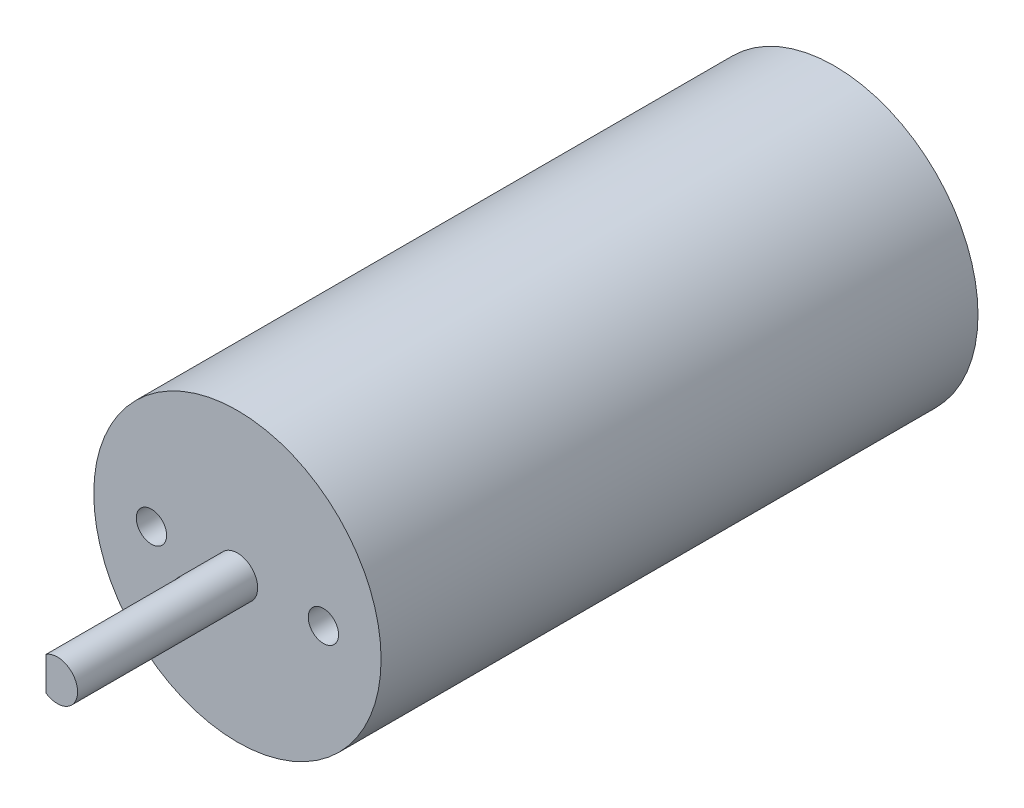
ISO-10303-21;
HEADER;
FILE_DESCRIPTION(('STEP AP214'),'2;1');
FILE_NAME('part.step','',(''),(''),'','','');
FILE_SCHEMA(('AUTOMOTIVE_DESIGN { 1 0 10303 214 1 1 1 1 }'));
ENDSEC;
DATA;
#1=APPLICATION_CONTEXT('core data for automotive mechanical design processes');
#2=APPLICATION_PROTOCOL_DEFINITION('international standard','automotive_design',2000,#1);
#3=PRODUCT_CONTEXT('',#1,'mechanical');
#4=PRODUCT('Part','Part','',(#3));
#5=PRODUCT_RELATED_PRODUCT_CATEGORY('part','',(#4));
#6=PRODUCT_DEFINITION_FORMATION('','',#4);
#7=PRODUCT_DEFINITION_CONTEXT('part definition',#1,'design');
#8=PRODUCT_DEFINITION('design','',#6,#7);
#9=PRODUCT_DEFINITION_SHAPE('','',#8);
#10=(LENGTH_UNIT() NAMED_UNIT(*) SI_UNIT(.MILLI.,.METRE.));
#11=(NAMED_UNIT(*) PLANE_ANGLE_UNIT() SI_UNIT($,.RADIAN.));
#12=(NAMED_UNIT(*) SI_UNIT($,.STERADIAN.) SOLID_ANGLE_UNIT());
#13=UNCERTAINTY_MEASURE_WITH_UNIT(LENGTH_MEASURE(1.E-05),#10,'distance_accuracy_value','');
#14=(GEOMETRIC_REPRESENTATION_CONTEXT(3) GLOBAL_UNCERTAINTY_ASSIGNED_CONTEXT((#13)) GLOBAL_UNIT_ASSIGNED_CONTEXT((#10,
#11,#12)) REPRESENTATION_CONTEXT('',''));
#15=CARTESIAN_POINT('',(0.,0.,0.));
#16=DIRECTION('',(0.,0.,1.));
#17=DIRECTION('',(1.,0.,0.));
#18=AXIS2_PLACEMENT_3D('',#15,#16,#17);
#19=CARTESIAN_POINT('',(0.,0.,76.8));
#20=DIRECTION('',(0.,0.,-1.));
#21=DIRECTION('',(-1.,0.,0.));
#22=AXIS2_PLACEMENT_3D('',#19,#20,#21);
#23=CYLINDRICAL_SURFACE('',#22,2.);
#24=CARTESIAN_POINT('',(0.,0.,59.));
#25=DIRECTION('',(0.,0.,1.));
#26=DIRECTION('',(1.,0.,0.));
#27=AXIS2_PLACEMENT_3D('',#24,#25,#26);
#28=CIRCLE('',#27,2.);
#29=CARTESIAN_POINT('',(2.,0.,59.));
#30=VERTEX_POINT('',#29);
#31=EDGE_CURVE('E91',#30,#30,#28,.T.);
#32=ORIENTED_EDGE('',*,*,#31,.T.);
#33=EDGE_LOOP('',(#32));
#34=FACE_BOUND('',#33,.T.);
#35=DIRECTION('',(0.,0.,-1.));
#36=VECTOR('',#35,1.);
#37=CARTESIAN_POINT('',(-1.12179318114657,1.65577174113253,76.8));
#38=LINE('',#37,#36);
#39=CARTESIAN_POINT('',(-1.12179318114657,1.65577174113253,76.8));
#40=VERTEX_POINT('',#39);
#41=CARTESIAN_POINT('',(-1.12179318114657,1.65577174113253,63.5));
#42=VERTEX_POINT('',#41);
#43=EDGE_CURVE('E75',#40,#42,#38,.T.);
#44=ORIENTED_EDGE('',*,*,#43,.F.);
#45=CARTESIAN_POINT('',(0.,0.,76.8));
#46=DIRECTION('',(0.,0.,1.));
#47=DIRECTION('',(1.,0.,0.));
#48=AXIS2_PLACEMENT_3D('',#45,#46,#47);
#49=CIRCLE('',#48,2.);
#50=CARTESIAN_POINT('',(-1.12179318114657,-1.65577174113253,76.8));
#51=VERTEX_POINT('',#50);
#52=EDGE_CURVE('E80',#51,#40,#49,.T.);
#53=ORIENTED_EDGE('',*,*,#52,.F.);
#54=DIRECTION('',(0.,0.,-1.));
#55=VECTOR('',#54,1.);
#56=CARTESIAN_POINT('',(-1.12179318114657,-1.65577174113253,76.8));
#57=LINE('',#56,#55);
#58=CARTESIAN_POINT('',(-1.12179318114657,-1.65577174113253,63.5));
#59=VERTEX_POINT('',#58);
#60=EDGE_CURVE('E60',#59,#51,#57,.F.);
#61=ORIENTED_EDGE('',*,*,#60,.F.);
#62=CARTESIAN_POINT('',(0.,0.,63.5));
#63=DIRECTION('',(0.,0.,-1.));
#64=DIRECTION('',(-1.,0.,0.));
#65=AXIS2_PLACEMENT_3D('',#62,#63,#64);
#66=CIRCLE('',#65,2.);
#67=EDGE_CURVE('E11',#59,#42,#66,.T.);
#68=ORIENTED_EDGE('',*,*,#67,.T.);
#69=EDGE_LOOP('',(#44,#53,#61,#68));
#70=FACE_BOUND('',#69,.T.);
#71=ADVANCED_FACE('F44',(#34,#70),#23,.T.);
#72=CARTESIAN_POINT('',(0.,0.,76.8));
#73=DIRECTION('',(0.,0.,1.));
#74=DIRECTION('',(1.,0.,0.));
#75=AXIS2_PLACEMENT_3D('',#72,#73,#74);
#76=PLANE('',#75);
#77=ORIENTED_EDGE('',*,*,#52,.T.);
#78=DIRECTION('',(0.,-1.,0.));
#79=VECTOR('',#78,1.);
#80=CARTESIAN_POINT('',(-1.12179318114657,0.,76.8));
#81=LINE('',#80,#79);
#82=EDGE_CURVE('E53',#40,#51,#81,.T.);
#83=ORIENTED_EDGE('',*,*,#82,.T.);
#84=EDGE_LOOP('',(#77,#83));
#85=FACE_BOUND('',#84,.T.);
#86=ADVANCED_FACE('F117',(#85),#76,.T.);
#87=CARTESIAN_POINT('',(0.,0.,59.));
#88=DIRECTION('',(0.,0.,-1.));
#89=DIRECTION('',(-1.,0.,0.));
#90=AXIS2_PLACEMENT_3D('',#87,#88,#89);
#91=CYLINDRICAL_SURFACE('',#90,14.2);
#92=CARTESIAN_POINT('',(0.,0.,59.));
#93=DIRECTION('',(0.,0.,1.));
#94=DIRECTION('',(1.,0.,0.));
#95=AXIS2_PLACEMENT_3D('',#92,#93,#94);
#96=CIRCLE('',#95,14.2);
#97=CARTESIAN_POINT('',(14.2,0.,59.));
#98=VERTEX_POINT('',#97);
#99=EDGE_CURVE('E109',#98,#98,#96,.T.);
#100=ORIENTED_EDGE('',*,*,#99,.F.);
#101=EDGE_LOOP('',(#100));
#102=FACE_BOUND('',#101,.T.);
#103=CARTESIAN_POINT('',(0.,0.,0.));
#104=DIRECTION('',(0.,0.,1.));
#105=DIRECTION('',(1.,0.,0.));
#106=AXIS2_PLACEMENT_3D('',#103,#104,#105);
#107=CIRCLE('',#106,14.2);
#108=CARTESIAN_POINT('',(14.2,0.,0.));
#109=VERTEX_POINT('',#108);
#110=EDGE_CURVE('E105',#109,#109,#107,.T.);
#111=ORIENTED_EDGE('',*,*,#110,.T.);
#112=EDGE_LOOP('',(#111));
#113=FACE_BOUND('',#112,.T.);
#114=ADVANCED_FACE('F46',(#102,#113),#91,.T.);
#115=CARTESIAN_POINT('',(0.,0.,59.));
#116=DIRECTION('',(0.,0.,1.));
#117=DIRECTION('',(1.,0.,0.));
#118=AXIS2_PLACEMENT_3D('',#115,#116,#117);
#119=PLANE('',#118);
#120=CARTESIAN_POINT('',(-8.5,0.,59.));
#121=DIRECTION('',(0.,0.,1.));
#122=DIRECTION('',(1.,0.,0.));
#123=AXIS2_PLACEMENT_3D('',#120,#121,#122);
#124=CIRCLE('',#123,1.5);
#125=CARTESIAN_POINT('',(-7.,0.,59.));
#126=VERTEX_POINT('',#125);
#127=EDGE_CURVE('E92',#126,#126,#124,.T.);
#128=ORIENTED_EDGE('',*,*,#127,.F.);
#129=EDGE_LOOP('',(#128));
#130=FACE_BOUND('',#129,.T.);
#131=CARTESIAN_POINT('',(8.5,0.,59.));
#132=DIRECTION('',(0.,0.,1.));
#133=DIRECTION('',(1.,0.,0.));
#134=AXIS2_PLACEMENT_3D('',#131,#132,#133);
#135=CIRCLE('',#134,1.5);
#136=CARTESIAN_POINT('',(10.,0.,59.));
#137=VERTEX_POINT('',#136);
#138=EDGE_CURVE('E96',#137,#137,#135,.T.);
#139=ORIENTED_EDGE('',*,*,#138,.F.);
#140=EDGE_LOOP('',(#139));
#141=FACE_BOUND('',#140,.T.);
#142=ORIENTED_EDGE('',*,*,#31,.F.);
#143=EDGE_LOOP('',(#142));
#144=FACE_BOUND('',#143,.T.);
#145=ORIENTED_EDGE('',*,*,#99,.T.);
#146=EDGE_LOOP('',(#145));
#147=FACE_BOUND('',#146,.T.);
#148=ADVANCED_FACE('F125',(#130,#141,#144,#147),#119,.T.);
#149=CARTESIAN_POINT('',(0.,0.,0.));
#150=DIRECTION('',(0.,0.,1.));
#151=DIRECTION('',(1.,0.,0.));
#152=AXIS2_PLACEMENT_3D('',#149,#150,#151);
#153=PLANE('',#152);
#154=ORIENTED_EDGE('',*,*,#110,.F.);
#155=EDGE_LOOP('',(#154));
#156=FACE_BOUND('',#155,.T.);
#157=ADVANCED_FACE('F134',(#156),#153,.F.);
#158=CARTESIAN_POINT('',(8.5,0.,54.6058));
#159=DIRECTION('',(0.,0.,1.));
#160=DIRECTION('',(1.,0.,0.));
#161=AXIS2_PLACEMENT_3D('',#158,#159,#160);
#162=CYLINDRICAL_SURFACE('',#161,1.5);
#163=CARTESIAN_POINT('',(8.5,0.,54.6058));
#164=DIRECTION('',(0.,0.,1.));
#165=DIRECTION('',(1.,0.,0.));
#166=AXIS2_PLACEMENT_3D('',#163,#164,#165);
#167=CIRCLE('',#166,1.5);
#168=CARTESIAN_POINT('',(10.,0.,54.6058));
#169=VERTEX_POINT('',#168);
#170=EDGE_CURVE('E84',#169,#169,#167,.T.);
#171=ORIENTED_EDGE('',*,*,#170,.F.);
#172=EDGE_LOOP('',(#171));
#173=FACE_BOUND('',#172,.T.);
#174=ORIENTED_EDGE('',*,*,#138,.T.);
#175=EDGE_LOOP('',(#174));
#176=FACE_BOUND('',#175,.T.);
#177=ADVANCED_FACE('F137',(#173,#176),#162,.F.);
#178=CARTESIAN_POINT('',(8.5,0.,54.6058));
#179=DIRECTION('',(0.,0.,1.));
#180=DIRECTION('',(1.,0.,0.));
#181=AXIS2_PLACEMENT_3D('',#178,#179,#180);
#182=PLANE('',#181);
#183=ORIENTED_EDGE('',*,*,#170,.T.);
#184=EDGE_LOOP('',(#183));
#185=FACE_BOUND('',#184,.T.);
#186=ADVANCED_FACE('F130',(#185),#182,.T.);
#187=CARTESIAN_POINT('',(-8.5,0.,54.6058));
#188=DIRECTION('',(0.,0.,1.));
#189=DIRECTION('',(1.,0.,0.));
#190=AXIS2_PLACEMENT_3D('',#187,#188,#189);
#191=CYLINDRICAL_SURFACE('',#190,1.5);
#192=CARTESIAN_POINT('',(-8.5,0.,54.6058));
#193=DIRECTION('',(0.,0.,1.));
#194=DIRECTION('',(1.,0.,0.));
#195=AXIS2_PLACEMENT_3D('',#192,#193,#194);
#196=CIRCLE('',#195,1.5);
#197=CARTESIAN_POINT('',(-7.,0.,54.6058));
#198=VERTEX_POINT('',#197);
#199=EDGE_CURVE('E87',#198,#198,#196,.T.);
#200=ORIENTED_EDGE('',*,*,#199,.F.);
#201=EDGE_LOOP('',(#200));
#202=FACE_BOUND('',#201,.T.);
#203=ORIENTED_EDGE('',*,*,#127,.T.);
#204=EDGE_LOOP('',(#203));
#205=FACE_BOUND('',#204,.T.);
#206=ADVANCED_FACE('F148',(#202,#205),#191,.F.);
#207=CARTESIAN_POINT('',(-8.5,0.,54.6058));
#208=DIRECTION('',(0.,0.,1.));
#209=DIRECTION('',(1.,0.,0.));
#210=AXIS2_PLACEMENT_3D('',#207,#208,#209);
#211=PLANE('',#210);
#212=ORIENTED_EDGE('',*,*,#199,.T.);
#213=EDGE_LOOP('',(#212));
#214=FACE_BOUND('',#213,.T.);
#215=ADVANCED_FACE('F155',(#214),#211,.T.);
#216=CARTESIAN_POINT('',(0.,0.,63.5));
#217=DIRECTION('',(0.,0.,-1.));
#218=DIRECTION('',(-1.,0.,0.));
#219=AXIS2_PLACEMENT_3D('',#216,#217,#218);
#220=PLANE('',#219);
#221=DIRECTION('',(0.,1.,0.));
#222=VECTOR('',#221,1.);
#223=CARTESIAN_POINT('',(-1.12179318114657,2.03962396572122,63.5));
#224=LINE('',#223,#222);
#225=EDGE_CURVE('E72',#59,#42,#224,.T.);
#226=ORIENTED_EDGE('',*,*,#225,.T.);
#227=ORIENTED_EDGE('',*,*,#67,.F.);
#228=EDGE_LOOP('',(#226,#227));
#229=FACE_BOUND('',#228,.T.);
#230=ADVANCED_FACE('F71',(#229),#220,.F.);
#231=CARTESIAN_POINT('',(-1.12179318114657,2.03962396572122,77.216));
#232=DIRECTION('',(-1.,0.,0.));
#233=DIRECTION('',(0.,0.,1.));
#234=AXIS2_PLACEMENT_3D('',#231,#232,#233);
#235=PLANE('',#234);
#236=ORIENTED_EDGE('',*,*,#43,.T.);
#237=ORIENTED_EDGE('',*,*,#225,.F.);
#238=ORIENTED_EDGE('',*,*,#60,.T.);
#239=ORIENTED_EDGE('',*,*,#82,.F.);
#240=EDGE_LOOP('',(#236,#237,#238,#239));
#241=FACE_BOUND('',#240,.T.);
#242=ADVANCED_FACE('F74',(#241),#235,.T.);
#243=CLOSED_SHELL('',(#71,#86,#114,#148,#157,#177,#186,#206,#215,#230,#242));
#244=MANIFOLD_SOLID_BREP('B2',#243);
#245=ADVANCED_BREP_SHAPE_REPRESENTATION('',(#18,#244),#14);
#246=SHAPE_DEFINITION_REPRESENTATION(#9,#245);
ENDSEC;
END-ISO-10303-21;
